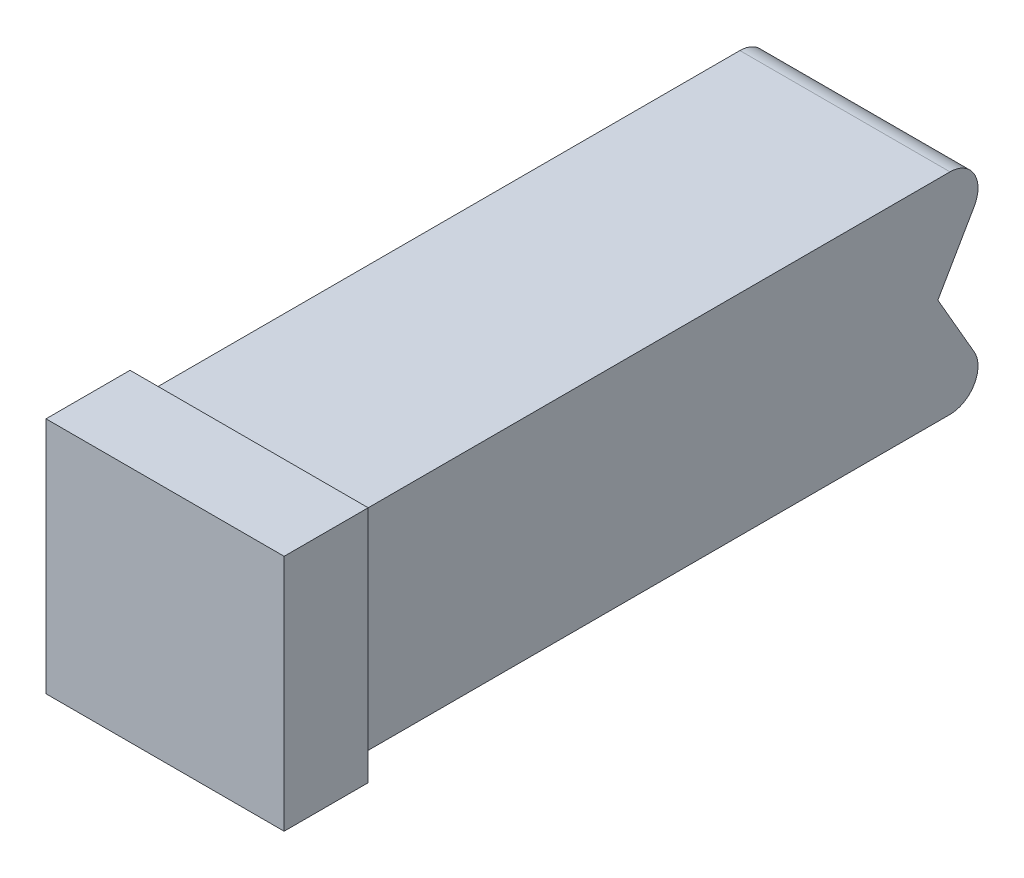
ISO-10303-21;
HEADER;
FILE_DESCRIPTION(('STEP AP214'),'2;1');
FILE_NAME('part.step','',(''),(''),'','','');
FILE_SCHEMA(('AUTOMOTIVE_DESIGN { 1 0 10303 214 1 1 1 1 }'));
ENDSEC;
DATA;
#1=APPLICATION_CONTEXT('core data for automotive mechanical design processes');
#2=APPLICATION_PROTOCOL_DEFINITION('international standard','automotive_design',2000,#1);
#3=PRODUCT_CONTEXT('',#1,'mechanical');
#4=PRODUCT('Part','Part','',(#3));
#5=PRODUCT_RELATED_PRODUCT_CATEGORY('part','',(#4));
#6=PRODUCT_DEFINITION_FORMATION('','',#4);
#7=PRODUCT_DEFINITION_CONTEXT('part definition',#1,'design');
#8=PRODUCT_DEFINITION('design','',#6,#7);
#9=PRODUCT_DEFINITION_SHAPE('','',#8);
#10=(LENGTH_UNIT() NAMED_UNIT(*) SI_UNIT(.MILLI.,.METRE.));
#11=(NAMED_UNIT(*) PLANE_ANGLE_UNIT() SI_UNIT($,.RADIAN.));
#12=(NAMED_UNIT(*) SI_UNIT($,.STERADIAN.) SOLID_ANGLE_UNIT());
#13=UNCERTAINTY_MEASURE_WITH_UNIT(LENGTH_MEASURE(1.E-05),#10,'distance_accuracy_value','');
#14=(GEOMETRIC_REPRESENTATION_CONTEXT(3) GLOBAL_UNCERTAINTY_ASSIGNED_CONTEXT((#13)) GLOBAL_UNIT_ASSIGNED_CONTEXT((#10,
#11,#12)) REPRESENTATION_CONTEXT('',''));
#15=CARTESIAN_POINT('',(0.,0.,0.));
#16=DIRECTION('',(0.,0.,1.));
#17=DIRECTION('',(1.,0.,0.));
#18=AXIS2_PLACEMENT_3D('',#15,#16,#17);
#19=CARTESIAN_POINT('',(0.5,1.5,-21.2679491924311));
#20=DIRECTION('',(1.,0.,0.));
#21=DIRECTION('',(0.,0.,-1.));
#22=AXIS2_PLACEMENT_3D('',#19,#20,#21);
#23=PLANE('',#22);
#24=DIRECTION('',(0.,-1.,0.));
#25=VECTOR('',#24,1.);
#26=CARTESIAN_POINT('',(0.5,0.,0.));
#27=LINE('',#26,#25);
#28=CARTESIAN_POINT('',(0.5,8.,0.));
#29=VERTEX_POINT('',#28);
#30=CARTESIAN_POINT('',(0.5,0.5,0.));
#31=VERTEX_POINT('',#30);
#32=EDGE_CURVE('E12',#29,#31,#27,.T.);
#33=ORIENTED_EDGE('',*,*,#32,.F.);
#34=DIRECTION('',(0.,0.,-1.));
#35=VECTOR('',#34,1.);
#36=CARTESIAN_POINT('',(0.5,8.,-20.8349364905389));
#37=LINE('',#36,#35);
#38=CARTESIAN_POINT('',(0.5,8.,-21.2679491924311));
#39=VERTEX_POINT('',#38);
#40=EDGE_CURVE('E182',#29,#39,#37,.T.);
#41=ORIENTED_EDGE('',*,*,#40,.T.);
#42=CARTESIAN_POINT('',(0.5,7.,-21.2679491924311));
#43=DIRECTION('',(-1.,0.,0.));
#44=DIRECTION('',(0.,0.,-1.));
#45=AXIS2_PLACEMENT_3D('',#42,#43,#44);
#46=CIRCLE('',#45,1.00000000000001);
#47=CARTESIAN_POINT('',(0.5,6.5,-22.1339745962156));
#48=VERTEX_POINT('',#47);
#49=EDGE_CURVE('E204',#39,#48,#46,.T.);
#50=ORIENTED_EDGE('',*,*,#49,.T.);
#51=DIRECTION('',(0.,-0.866025403784437,0.500000000000003));
#52=VECTOR('',#51,1.);
#53=CARTESIAN_POINT('',(0.5,4.99999999999996,-21.2679491924311));
#54=LINE('',#53,#52);
#55=CARTESIAN_POINT('',(0.5,4.24999999999999,-20.8349364905389));
#56=VERTEX_POINT('',#55);
#57=EDGE_CURVE('E207',#48,#56,#54,.T.);
#58=ORIENTED_EDGE('',*,*,#57,.T.);
#59=DIRECTION('',(0.,-0.866025403784437,-0.500000000000003));
#60=VECTOR('',#59,1.);
#61=CARTESIAN_POINT('',(0.5,1.99999999999999,-22.1339745962156));
#62=LINE('',#61,#60);
#63=CARTESIAN_POINT('',(0.5,1.99999999999999,-22.1339745962156));
#64=VERTEX_POINT('',#63);
#65=EDGE_CURVE('E209',#56,#64,#62,.T.);
#66=ORIENTED_EDGE('',*,*,#65,.T.);
#67=CARTESIAN_POINT('',(0.5,1.5,-21.2679491924311));
#68=DIRECTION('',(-1.,0.,0.));
#69=DIRECTION('',(0.,0.,-1.));
#70=AXIS2_PLACEMENT_3D('',#67,#68,#69);
#71=CIRCLE('',#70,1.00000000000001);
#72=CARTESIAN_POINT('',(0.5,0.5,-21.2679491924311));
#73=VERTEX_POINT('',#72);
#74=EDGE_CURVE('E201',#64,#73,#71,.T.);
#75=ORIENTED_EDGE('',*,*,#74,.T.);
#76=DIRECTION('',(0.,0.,-1.));
#77=VECTOR('',#76,1.);
#78=CARTESIAN_POINT('',(0.5,0.5,-20.8349364905389));
#79=LINE('',#78,#77);
#80=EDGE_CURVE('E188',#31,#73,#79,.T.);
#81=ORIENTED_EDGE('',*,*,#80,.F.);
#82=EDGE_LOOP('',(#33,#41,#50,#58,#66,#75,#81));
#83=FACE_BOUND('',#82,.T.);
#84=ADVANCED_FACE('F48',(#83),#23,.F.);
#85=CARTESIAN_POINT('',(8.5,8.5,0.));
#86=DIRECTION('',(0.,1.,0.));
#87=DIRECTION('',(-1.,0.,0.));
#88=AXIS2_PLACEMENT_3D('',#85,#86,#87);
#89=PLANE('',#88);
#90=DIRECTION('',(0.,0.,1.));
#91=VECTOR('',#90,1.);
#92=CARTESIAN_POINT('',(8.5,8.5,0.));
#93=LINE('',#92,#91);
#94=CARTESIAN_POINT('',(8.5,8.5,3.));
#95=VERTEX_POINT('',#94);
#96=CARTESIAN_POINT('',(8.5,8.5,0.));
#97=VERTEX_POINT('',#96);
#98=EDGE_CURVE('E147',#95,#97,#93,.F.);
#99=ORIENTED_EDGE('',*,*,#98,.T.);
#100=DIRECTION('',(1.,0.,0.));
#101=VECTOR('',#100,1.);
#102=CARTESIAN_POINT('',(0.5,8.5,0.));
#103=LINE('',#102,#101);
#104=CARTESIAN_POINT('',(0.,8.5,0.));
#105=VERTEX_POINT('',#104);
#106=EDGE_CURVE('E141',#105,#97,#103,.T.);
#107=ORIENTED_EDGE('',*,*,#106,.F.);
#108=DIRECTION('',(0.,0.,-1.));
#109=VECTOR('',#108,1.);
#110=CARTESIAN_POINT('',(0.,8.5,0.));
#111=LINE('',#110,#109);
#112=CARTESIAN_POINT('',(0.,8.5,3.));
#113=VERTEX_POINT('',#112);
#114=EDGE_CURVE('E145',#113,#105,#111,.T.);
#115=ORIENTED_EDGE('',*,*,#114,.F.);
#116=DIRECTION('',(-1.,0.,0.));
#117=VECTOR('',#116,1.);
#118=CARTESIAN_POINT('',(8.5,8.5,3.));
#119=LINE('',#118,#117);
#120=EDGE_CURVE('E65',#113,#95,#119,.F.);
#121=ORIENTED_EDGE('',*,*,#120,.T.);
#122=EDGE_LOOP('',(#99,#107,#115,#121));
#123=FACE_BOUND('',#122,.T.);
#124=ADVANCED_FACE('F143',(#123),#89,.T.);
#125=CARTESIAN_POINT('',(8.5,0.,0.));
#126=DIRECTION('',(1.,0.,0.));
#127=DIRECTION('',(0.,0.,-1.));
#128=AXIS2_PLACEMENT_3D('',#125,#126,#127);
#129=PLANE('',#128);
#130=DIRECTION('',(0.,0.,1.));
#131=VECTOR('',#130,1.);
#132=CARTESIAN_POINT('',(8.5,0.,3.));
#133=LINE('',#132,#131);
#134=CARTESIAN_POINT('',(8.5,0.,0.));
#135=VERTEX_POINT('',#134);
#136=CARTESIAN_POINT('',(8.5,0.,3.));
#137=VERTEX_POINT('',#136);
#138=EDGE_CURVE('E194',#135,#137,#133,.T.);
#139=ORIENTED_EDGE('',*,*,#138,.F.);
#140=DIRECTION('',(0.,-1.,0.));
#141=VECTOR('',#140,1.);
#142=CARTESIAN_POINT('',(8.5,8.5,0.));
#143=LINE('',#142,#141);
#144=EDGE_CURVE('E150',#97,#135,#143,.T.);
#145=ORIENTED_EDGE('',*,*,#144,.F.);
#146=ORIENTED_EDGE('',*,*,#98,.F.);
#147=DIRECTION('',(0.,1.,0.));
#148=VECTOR('',#147,1.);
#149=CARTESIAN_POINT('',(8.5,0.,3.));
#150=LINE('',#149,#148);
#151=EDGE_CURVE('E217',#95,#137,#150,.F.);
#152=ORIENTED_EDGE('',*,*,#151,.T.);
#153=EDGE_LOOP('',(#139,#145,#146,#152));
#154=FACE_BOUND('',#153,.T.);
#155=ADVANCED_FACE('F434',(#154),#129,.T.);
#156=CARTESIAN_POINT('',(0.,0.,0.));
#157=DIRECTION('',(0.,1.,0.));
#158=DIRECTION('',(0.,0.,1.));
#159=AXIS2_PLACEMENT_3D('',#156,#157,#158);
#160=PLANE('',#159);
#161=DIRECTION('',(-1.,0.,0.));
#162=VECTOR('',#161,1.);
#163=CARTESIAN_POINT('',(8.5,0.,0.));
#164=LINE('',#163,#162);
#165=CARTESIAN_POINT('',(0.,0.,0.));
#166=VERTEX_POINT('',#165);
#167=EDGE_CURVE('E158',#135,#166,#164,.T.);
#168=ORIENTED_EDGE('',*,*,#167,.F.);
#169=ORIENTED_EDGE('',*,*,#138,.T.);
#170=DIRECTION('',(-1.,0.,0.));
#171=VECTOR('',#170,1.);
#172=CARTESIAN_POINT('',(0.5,0.,3.));
#173=LINE('',#172,#171);
#174=CARTESIAN_POINT('',(0.,0.,3.));
#175=VERTEX_POINT('',#174);
#176=EDGE_CURVE('E196',#137,#175,#173,.T.);
#177=ORIENTED_EDGE('',*,*,#176,.T.);
#178=DIRECTION('',(0.,0.,1.));
#179=VECTOR('',#178,1.);
#180=CARTESIAN_POINT('',(0.,0.,3.));
#181=LINE('',#180,#179);
#182=EDGE_CURVE('E162',#166,#175,#181,.T.);
#183=ORIENTED_EDGE('',*,*,#182,.F.);
#184=EDGE_LOOP('',(#168,#169,#177,#183));
#185=FACE_BOUND('',#184,.T.);
#186=ADVANCED_FACE('F437',(#185),#160,.F.);
#187=CARTESIAN_POINT('',(8.,0.5,-23.));
#188=DIRECTION('',(0.,-0.500000000000003,0.866025403784437));
#189=DIRECTION('',(0.,-0.866025403784437,-0.500000000000003));
#190=AXIS2_PLACEMENT_3D('',#187,#188,#189);
#191=PLANE('',#190);
#192=DIRECTION('',(0.,0.866025403784431,0.500000000000012));
#193=VECTOR('',#192,1.);
#194=CARTESIAN_POINT('',(8.,2.00000000000001,-22.1339745962156));
#195=LINE('',#194,#193);
#196=CARTESIAN_POINT('',(8.,2.00000000000001,-22.1339745962156));
#197=VERTEX_POINT('',#196);
#198=CARTESIAN_POINT('',(8.,4.24999999999999,-20.8349364905389));
#199=VERTEX_POINT('',#198);
#200=EDGE_CURVE('E199',#197,#199,#195,.T.);
#201=ORIENTED_EDGE('',*,*,#200,.F.);
#202=DIRECTION('',(1.,0.,0.));
#203=VECTOR('',#202,1.);
#204=CARTESIAN_POINT('',(8.,1.99999999999998,-22.1339745962156));
#205=LINE('',#204,#203);
#206=EDGE_CURVE('E52',#64,#197,#205,.T.);
#207=ORIENTED_EDGE('',*,*,#206,.F.);
#208=ORIENTED_EDGE('',*,*,#65,.F.);
#209=DIRECTION('',(-1.,0.,0.));
#210=VECTOR('',#209,1.);
#211=CARTESIAN_POINT('',(8.,4.24999999999999,-20.8349364905389));
#212=LINE('',#211,#210);
#213=EDGE_CURVE('E185',#199,#56,#212,.T.);
#214=ORIENTED_EDGE('',*,*,#213,.F.);
#215=EDGE_LOOP('',(#201,#207,#208,#214));
#216=FACE_BOUND('',#215,.T.);
#217=ADVANCED_FACE('F412',(#216),#191,.F.);
#218=CARTESIAN_POINT('',(8.,1.5,-21.2679491924311));
#219=DIRECTION('',(-1.,0.,0.));
#220=DIRECTION('',(0.,0.,1.));
#221=AXIS2_PLACEMENT_3D('',#218,#219,#220);
#222=CYLINDRICAL_SURFACE('',#221,1.);
#223=ORIENTED_EDGE('',*,*,#206,.T.);
#224=CARTESIAN_POINT('',(8.,1.5,-21.2679491924311));
#225=DIRECTION('',(1.,0.,0.));
#226=DIRECTION('',(0.,0.,-1.));
#227=AXIS2_PLACEMENT_3D('',#224,#225,#226);
#228=CIRCLE('',#227,1.00000000000002);
#229=CARTESIAN_POINT('',(8.,0.5,-21.2679491924311));
#230=VERTEX_POINT('',#229);
#231=EDGE_CURVE('E93',#230,#197,#228,.T.);
#232=ORIENTED_EDGE('',*,*,#231,.F.);
#233=DIRECTION('',(1.,0.,0.));
#234=VECTOR('',#233,1.);
#235=CARTESIAN_POINT('',(8.,0.5,-21.2679491924311));
#236=LINE('',#235,#234);
#237=EDGE_CURVE('E220',#73,#230,#236,.T.);
#238=ORIENTED_EDGE('',*,*,#237,.F.);
#239=ORIENTED_EDGE('',*,*,#74,.F.);
#240=EDGE_LOOP('',(#223,#232,#238,#239));
#241=FACE_BOUND('',#240,.T.);
#242=ADVANCED_FACE('F406',(#241),#222,.T.);
#243=CARTESIAN_POINT('',(4.25,4.25,3.));
#244=DIRECTION('',(0.,0.,1.));
#245=DIRECTION('',(1.,0.,0.));
#246=AXIS2_PLACEMENT_3D('',#243,#244,#245);
#247=PLANE('',#246);
#248=ORIENTED_EDGE('',*,*,#120,.F.);
#249=DIRECTION('',(0.,1.,0.));
#250=VECTOR('',#249,1.);
#251=CARTESIAN_POINT('',(0.,8.5,3.));
#252=LINE('',#251,#250);
#253=EDGE_CURVE('E167',#175,#113,#252,.T.);
#254=ORIENTED_EDGE('',*,*,#253,.F.);
#255=ORIENTED_EDGE('',*,*,#176,.F.);
#256=ORIENTED_EDGE('',*,*,#151,.F.);
#257=EDGE_LOOP('',(#248,#254,#255,#256));
#258=FACE_BOUND('',#257,.T.);
#259=ADVANCED_FACE('F50',(#258),#247,.T.);
#260=CARTESIAN_POINT('',(0.5,7.,-21.2679491924311));
#261=DIRECTION('',(1.,0.,0.));
#262=DIRECTION('',(0.,0.,-1.));
#263=AXIS2_PLACEMENT_3D('',#260,#261,#262);
#264=CYLINDRICAL_SURFACE('',#263,1.00000000000001);
#265=CARTESIAN_POINT('',(8.,7.,-21.2679491924311));
#266=DIRECTION('',(-1.,0.,0.));
#267=DIRECTION('',(0.,0.,-1.));
#268=AXIS2_PLACEMENT_3D('',#265,#266,#267);
#269=CIRCLE('',#268,1.00000000000001);
#270=CARTESIAN_POINT('',(8.,8.,-21.2679491924311));
#271=VERTEX_POINT('',#270);
#272=CARTESIAN_POINT('',(8.,6.5,-22.1339745962156));
#273=VERTEX_POINT('',#272);
#274=EDGE_CURVE('E85',#271,#273,#269,.T.);
#275=ORIENTED_EDGE('',*,*,#274,.T.);
#276=DIRECTION('',(1.,0.,0.));
#277=VECTOR('',#276,1.);
#278=CARTESIAN_POINT('',(0.5,6.5,-22.1339745962156));
#279=LINE('',#278,#277);
#280=EDGE_CURVE('E211',#48,#273,#279,.T.);
#281=ORIENTED_EDGE('',*,*,#280,.F.);
#282=ORIENTED_EDGE('',*,*,#49,.F.);
#283=DIRECTION('',(1.,0.,0.));
#284=VECTOR('',#283,1.);
#285=CARTESIAN_POINT('',(0.5,8.,-21.2679491924311));
#286=LINE('',#285,#284);
#287=EDGE_CURVE('E215',#39,#271,#286,.T.);
#288=ORIENTED_EDGE('',*,*,#287,.T.);
#289=EDGE_LOOP('',(#275,#281,#282,#288));
#290=FACE_BOUND('',#289,.T.);
#291=ADVANCED_FACE('F427',(#290),#264,.T.);
#292=CARTESIAN_POINT('',(0.5,4.99999999999996,-21.2679491924311));
#293=DIRECTION('',(0.,0.500000000000003,0.866025403784437));
#294=DIRECTION('',(0.,-0.866025403784437,0.500000000000003));
#295=AXIS2_PLACEMENT_3D('',#292,#293,#294);
#296=PLANE('',#295);
#297=DIRECTION('',(0.,-0.866025403784437,0.500000000000003));
#298=VECTOR('',#297,1.);
#299=CARTESIAN_POINT('',(8.,4.99999999999996,-21.2679491924311));
#300=LINE('',#299,#298);
#301=EDGE_CURVE('E205',#273,#199,#300,.T.);
#302=ORIENTED_EDGE('',*,*,#301,.T.);
#303=ORIENTED_EDGE('',*,*,#213,.T.);
#304=ORIENTED_EDGE('',*,*,#57,.F.);
#305=ORIENTED_EDGE('',*,*,#280,.T.);
#306=EDGE_LOOP('',(#302,#303,#304,#305));
#307=FACE_BOUND('',#306,.T.);
#308=ADVANCED_FACE('F414',(#307),#296,.F.);
#309=CARTESIAN_POINT('',(8.,1.5,-21.2679491924311));
#310=DIRECTION('',(1.,0.,0.));
#311=DIRECTION('',(0.,0.,-1.));
#312=AXIS2_PLACEMENT_3D('',#309,#310,#311);
#313=PLANE('',#312);
#314=ORIENTED_EDGE('',*,*,#274,.F.);
#315=DIRECTION('',(0.,0.,-1.));
#316=VECTOR('',#315,1.);
#317=CARTESIAN_POINT('',(8.,8.,-20.8349364905389));
#318=LINE('',#317,#316);
#319=CARTESIAN_POINT('',(8.,8.,0.));
#320=VERTEX_POINT('',#319);
#321=EDGE_CURVE('E183',#320,#271,#318,.T.);
#322=ORIENTED_EDGE('',*,*,#321,.F.);
#323=DIRECTION('',(0.,1.,0.));
#324=VECTOR('',#323,1.);
#325=CARTESIAN_POINT('',(8.,0.5,0.));
#326=LINE('',#325,#324);
#327=CARTESIAN_POINT('',(8.,0.5,0.));
#328=VERTEX_POINT('',#327);
#329=EDGE_CURVE('E179',#328,#320,#326,.T.);
#330=ORIENTED_EDGE('',*,*,#329,.F.);
#331=DIRECTION('',(0.,0.,-1.));
#332=VECTOR('',#331,1.);
#333=CARTESIAN_POINT('',(8.,0.5,-20.8349364905389));
#334=LINE('',#333,#332);
#335=EDGE_CURVE('E186',#328,#230,#334,.T.);
#336=ORIENTED_EDGE('',*,*,#335,.T.);
#337=ORIENTED_EDGE('',*,*,#231,.T.);
#338=ORIENTED_EDGE('',*,*,#200,.T.);
#339=ORIENTED_EDGE('',*,*,#301,.F.);
#340=EDGE_LOOP('',(#314,#322,#330,#336,#337,#338,#339));
#341=FACE_BOUND('',#340,.T.);
#342=ADVANCED_FACE('F416',(#341),#313,.T.);
#343=CARTESIAN_POINT('',(8.,8.,-20.8349364905389));
#344=DIRECTION('',(0.,-1.,0.));
#345=DIRECTION('',(0.,0.,-1.));
#346=AXIS2_PLACEMENT_3D('',#343,#344,#345);
#347=PLANE('',#346);
#348=ORIENTED_EDGE('',*,*,#287,.F.);
#349=ORIENTED_EDGE('',*,*,#40,.F.);
#350=DIRECTION('',(-1.,0.,0.));
#351=VECTOR('',#350,1.);
#352=CARTESIAN_POINT('',(8.,8.,0.));
#353=LINE('',#352,#351);
#354=EDGE_CURVE('E151',#320,#29,#353,.T.);
#355=ORIENTED_EDGE('',*,*,#354,.F.);
#356=ORIENTED_EDGE('',*,*,#321,.T.);
#357=EDGE_LOOP('',(#348,#349,#355,#356));
#358=FACE_BOUND('',#357,.T.);
#359=ADVANCED_FACE('F418',(#358),#347,.F.);
#360=CARTESIAN_POINT('',(0.5,0.5,-20.8349364905389));
#361=DIRECTION('',(0.,1.,0.));
#362=DIRECTION('',(-1.,0.,0.));
#363=AXIS2_PLACEMENT_3D('',#360,#361,#362);
#364=PLANE('',#363);
#365=ORIENTED_EDGE('',*,*,#237,.T.);
#366=ORIENTED_EDGE('',*,*,#335,.F.);
#367=DIRECTION('',(1.,0.,0.));
#368=VECTOR('',#367,1.);
#369=CARTESIAN_POINT('',(0.5,0.5,0.));
#370=LINE('',#369,#368);
#371=EDGE_CURVE('E176',#31,#328,#370,.T.);
#372=ORIENTED_EDGE('',*,*,#371,.F.);
#373=ORIENTED_EDGE('',*,*,#80,.T.);
#374=EDGE_LOOP('',(#365,#366,#372,#373));
#375=FACE_BOUND('',#374,.T.);
#376=ADVANCED_FACE('F424',(#375),#364,.F.);
#377=CARTESIAN_POINT('',(0.,0.,0.));
#378=DIRECTION('',(0.,0.,-1.));
#379=DIRECTION('',(-1.,0.,0.));
#380=AXIS2_PLACEMENT_3D('',#377,#378,#379);
#381=PLANE('',#380);
#382=DIRECTION('',(0.,-1.,0.));
#383=VECTOR('',#382,1.);
#384=CARTESIAN_POINT('',(0.,0.,0.));
#385=LINE('',#384,#383);
#386=EDGE_CURVE('E154',#105,#166,#385,.T.);
#387=ORIENTED_EDGE('',*,*,#386,.F.);
#388=ORIENTED_EDGE('',*,*,#106,.T.);
#389=ORIENTED_EDGE('',*,*,#144,.T.);
#390=ORIENTED_EDGE('',*,*,#167,.T.);
#391=EDGE_LOOP('',(#387,#388,#389,#390));
#392=FACE_BOUND('',#391,.T.);
#393=ORIENTED_EDGE('',*,*,#354,.T.);
#394=ORIENTED_EDGE('',*,*,#32,.T.);
#395=ORIENTED_EDGE('',*,*,#371,.T.);
#396=ORIENTED_EDGE('',*,*,#329,.T.);
#397=EDGE_LOOP('',(#393,#394,#395,#396));
#398=FACE_BOUND('',#397,.T.);
#399=ADVANCED_FACE('F155',(#392,#398),#381,.T.);
#400=CARTESIAN_POINT('',(0.,0.,0.));
#401=DIRECTION('',(1.,0.,0.));
#402=DIRECTION('',(0.,0.,-1.));
#403=AXIS2_PLACEMENT_3D('',#400,#401,#402);
#404=PLANE('',#403);
#405=ORIENTED_EDGE('',*,*,#114,.T.);
#406=ORIENTED_EDGE('',*,*,#386,.T.);
#407=ORIENTED_EDGE('',*,*,#182,.T.);
#408=ORIENTED_EDGE('',*,*,#253,.T.);
#409=EDGE_LOOP('',(#405,#406,#407,#408));
#410=FACE_BOUND('',#409,.T.);
#411=ADVANCED_FACE('F165',(#410),#404,.F.);
#412=CLOSED_SHELL('',(#84,#124,#155,#186,#217,#242,#259,#291,#308,#342,#359,#376,#399,#411));
#413=MANIFOLD_SOLID_BREP('B2',#412);
#414=ADVANCED_BREP_SHAPE_REPRESENTATION('',(#18,#413),#14);
#415=SHAPE_DEFINITION_REPRESENTATION(#9,#414);
ENDSEC;
END-ISO-10303-21;
